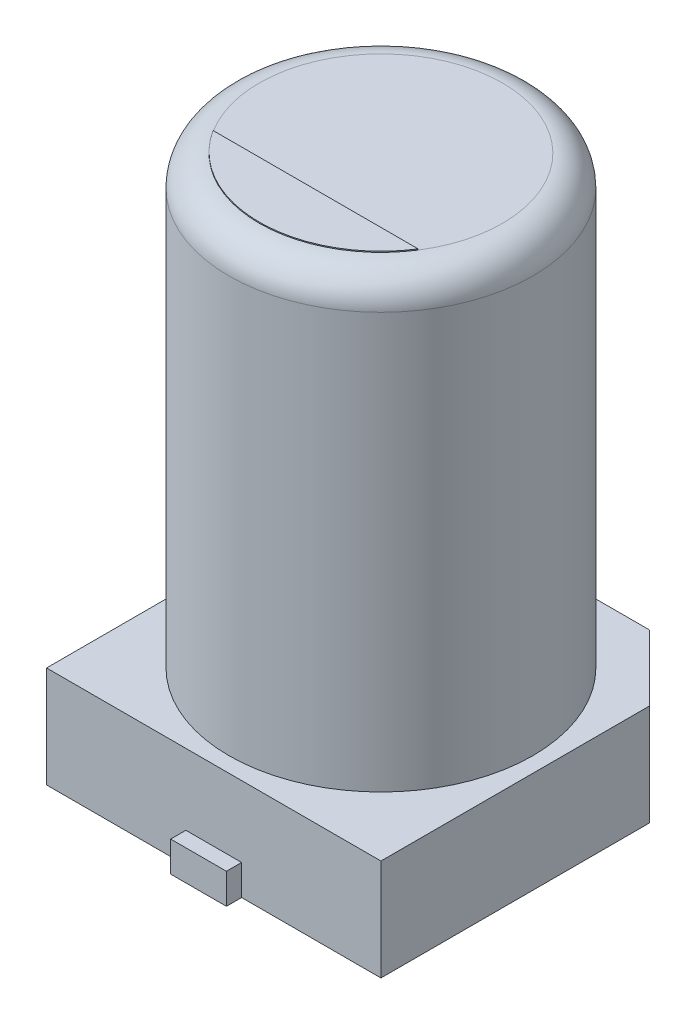
ISO-10303-21;
HEADER;
FILE_DESCRIPTION(('STEP AP214'),'2;1');
FILE_NAME('part.step','',(''),(''),'','','');
FILE_SCHEMA(('AUTOMOTIVE_DESIGN { 1 0 10303 214 1 1 1 1 }'));
ENDSEC;
DATA;
#1=APPLICATION_CONTEXT('core data for automotive mechanical design processes');
#2=APPLICATION_PROTOCOL_DEFINITION('international standard','automotive_design',2000,#1);
#3=PRODUCT_CONTEXT('',#1,'mechanical');
#4=PRODUCT('Part','Part','',(#3));
#5=PRODUCT_RELATED_PRODUCT_CATEGORY('part','',(#4));
#6=PRODUCT_DEFINITION_FORMATION('','',#4);
#7=PRODUCT_DEFINITION_CONTEXT('part definition',#1,'design');
#8=PRODUCT_DEFINITION('design','',#6,#7);
#9=PRODUCT_DEFINITION_SHAPE('','',#8);
#10=(LENGTH_UNIT() NAMED_UNIT(*) SI_UNIT(.MILLI.,.METRE.));
#11=(NAMED_UNIT(*) PLANE_ANGLE_UNIT() SI_UNIT($,.RADIAN.));
#12=(NAMED_UNIT(*) SI_UNIT($,.STERADIAN.) SOLID_ANGLE_UNIT());
#13=UNCERTAINTY_MEASURE_WITH_UNIT(LENGTH_MEASURE(1.E-05),#10,'distance_accuracy_value','');
#14=(GEOMETRIC_REPRESENTATION_CONTEXT(3) GLOBAL_UNCERTAINTY_ASSIGNED_CONTEXT((#13)) GLOBAL_UNIT_ASSIGNED_CONTEXT((#10,
#11,#12)) REPRESENTATION_CONTEXT('',''));
#15=CARTESIAN_POINT('',(0.,0.,0.));
#16=DIRECTION('',(0.,0.,1.));
#17=DIRECTION('',(1.,0.,0.));
#18=AXIS2_PLACEMENT_3D('',#15,#16,#17);
#19=CARTESIAN_POINT('',(0.,5.4,0.));
#20=DIRECTION('',(0.,1.,0.));
#21=DIRECTION('',(0.,0.,1.));
#22=AXIS2_PLACEMENT_3D('',#19,#20,#21);
#23=PLANE('',#22);
#24=CARTESIAN_POINT('',(0.,5.4,0.));
#25=DIRECTION('',(0.,1.,0.));
#26=DIRECTION('',(0.,0.,1.));
#27=AXIS2_PLACEMENT_3D('',#24,#25,#26);
#28=CIRCLE('',#27,1.2);
#29=CARTESIAN_POINT('',(1.01200566457573,5.4,0.644860089373367));
#30=VERTEX_POINT('',#29);
#31=CARTESIAN_POINT('',(-1.01200566457573,5.4,0.644860089373367));
#32=VERTEX_POINT('',#31);
#33=EDGE_CURVE('E221',#30,#32,#28,.T.);
#34=ORIENTED_EDGE('',*,*,#33,.T.);
#35=DIRECTION('',(-1.,0.,0.));
#36=VECTOR('',#35,1.);
#37=CARTESIAN_POINT('',(1.01200566457573,5.4,0.644860089373367));
#38=LINE('',#37,#36);
#39=EDGE_CURVE('E159',#30,#32,#38,.T.);
#40=ORIENTED_EDGE('',*,*,#39,.F.);
#41=EDGE_LOOP('',(#34,#40));
#42=FACE_BOUND('',#41,.T.);
#43=ADVANCED_FACE('F33',(#42),#23,.T.);
#44=CARTESIAN_POINT('',(-1.,1.,-1.65));
#45=DIRECTION('',(0.,0.,1.));
#46=DIRECTION('',(1.,0.,0.));
#47=AXIS2_PLACEMENT_3D('',#44,#45,#46);
#48=PLANE('',#47);
#49=DIRECTION('',(0.,-1.,0.));
#50=VECTOR('',#49,1.);
#51=CARTESIAN_POINT('',(0.275,1.,-1.65));
#52=LINE('',#51,#50);
#53=CARTESIAN_POINT('',(0.275,0.3,-1.65));
#54=VERTEX_POINT('',#53);
#55=CARTESIAN_POINT('',(0.275,0.,-1.65));
#56=VERTEX_POINT('',#55);
#57=EDGE_CURVE('E188',#54,#56,#52,.T.);
#58=ORIENTED_EDGE('',*,*,#57,.F.);
#59=DIRECTION('',(-1.,0.,0.));
#60=VECTOR('',#59,1.);
#61=CARTESIAN_POINT('',(-1.,0.3,-1.65));
#62=LINE('',#61,#60);
#63=CARTESIAN_POINT('',(-0.275,0.3,-1.65));
#64=VERTEX_POINT('',#63);
#65=EDGE_CURVE('E11',#54,#64,#62,.T.);
#66=ORIENTED_EDGE('',*,*,#65,.T.);
#67=DIRECTION('',(0.,1.,0.));
#68=VECTOR('',#67,1.);
#69=CARTESIAN_POINT('',(-0.275,1.,-1.65));
#70=LINE('',#69,#68);
#71=CARTESIAN_POINT('',(-0.275,0.,-1.65));
#72=VERTEX_POINT('',#71);
#73=EDGE_CURVE('E186',#72,#64,#70,.T.);
#74=ORIENTED_EDGE('',*,*,#73,.F.);
#75=DIRECTION('',(-1.,0.,0.));
#76=VECTOR('',#75,1.);
#77=CARTESIAN_POINT('',(-1.,0.,-1.65));
#78=LINE('',#77,#76);
#79=CARTESIAN_POINT('',(-1.,0.,-1.65));
#80=VERTEX_POINT('',#79);
#81=EDGE_CURVE('E242',#72,#80,#78,.T.);
#82=ORIENTED_EDGE('',*,*,#81,.T.);
#83=DIRECTION('',(0.,-1.,0.));
#84=VECTOR('',#83,1.);
#85=CARTESIAN_POINT('',(-1.,1.,-1.65));
#86=LINE('',#85,#84);
#87=CARTESIAN_POINT('',(-1.,1.,-1.65));
#88=VERTEX_POINT('',#87);
#89=EDGE_CURVE('E259',#88,#80,#86,.T.);
#90=ORIENTED_EDGE('',*,*,#89,.F.);
#91=DIRECTION('',(-1.,0.,0.));
#92=VECTOR('',#91,1.);
#93=CARTESIAN_POINT('',(-1.,1.,-1.65));
#94=LINE('',#93,#92);
#95=CARTESIAN_POINT('',(1.,1.,-1.65));
#96=VERTEX_POINT('',#95);
#97=EDGE_CURVE('E229',#96,#88,#94,.T.);
#98=ORIENTED_EDGE('',*,*,#97,.F.);
#99=DIRECTION('',(0.,-1.,0.));
#100=VECTOR('',#99,1.);
#101=CARTESIAN_POINT('',(1.,1.,-1.65));
#102=LINE('',#101,#100);
#103=CARTESIAN_POINT('',(1.,0.,-1.65));
#104=VERTEX_POINT('',#103);
#105=EDGE_CURVE('E262',#96,#104,#102,.T.);
#106=ORIENTED_EDGE('',*,*,#105,.T.);
#107=EDGE_CURVE('E243',#104,#56,#78,.T.);
#108=ORIENTED_EDGE('',*,*,#107,.T.);
#109=EDGE_LOOP('',(#58,#66,#74,#82,#90,#98,#106,#108));
#110=FACE_BOUND('',#109,.T.);
#111=ADVANCED_FACE('F319',(#110),#48,.F.);
#112=CARTESIAN_POINT('',(1.65,1.,1.65));
#113=DIRECTION('',(0.,0.,-1.));
#114=DIRECTION('',(-1.,0.,0.));
#115=AXIS2_PLACEMENT_3D('',#112,#113,#114);
#116=PLANE('',#115);
#117=DIRECTION('',(0.,-1.,0.));
#118=VECTOR('',#117,1.);
#119=CARTESIAN_POINT('',(-0.275,1.,1.65));
#120=LINE('',#119,#118);
#121=CARTESIAN_POINT('',(-0.275,0.3,1.65));
#122=VERTEX_POINT('',#121);
#123=CARTESIAN_POINT('',(-0.275,0.,1.65));
#124=VERTEX_POINT('',#123);
#125=EDGE_CURVE('E214',#122,#124,#120,.T.);
#126=ORIENTED_EDGE('',*,*,#125,.F.);
#127=DIRECTION('',(-1.,0.,0.));
#128=VECTOR('',#127,1.);
#129=CARTESIAN_POINT('',(1.65,0.3,1.65));
#130=LINE('',#129,#128);
#131=CARTESIAN_POINT('',(0.275,0.3,1.65));
#132=VERTEX_POINT('',#131);
#133=EDGE_CURVE('E41',#132,#122,#130,.T.);
#134=ORIENTED_EDGE('',*,*,#133,.F.);
#135=DIRECTION('',(0.,1.,0.));
#136=VECTOR('',#135,1.);
#137=CARTESIAN_POINT('',(0.275,1.,1.65));
#138=LINE('',#137,#136);
#139=CARTESIAN_POINT('',(0.275,0.,1.65));
#140=VERTEX_POINT('',#139);
#141=EDGE_CURVE('E211',#140,#132,#138,.T.);
#142=ORIENTED_EDGE('',*,*,#141,.F.);
#143=DIRECTION('',(1.,0.,0.));
#144=VECTOR('',#143,1.);
#145=CARTESIAN_POINT('',(1.65,0.,1.65));
#146=LINE('',#145,#144);
#147=CARTESIAN_POINT('',(1.65,0.,1.65));
#148=VERTEX_POINT('',#147);
#149=EDGE_CURVE('E249',#140,#148,#146,.T.);
#150=ORIENTED_EDGE('',*,*,#149,.T.);
#151=DIRECTION('',(0.,-1.,0.));
#152=VECTOR('',#151,1.);
#153=CARTESIAN_POINT('',(1.65,1.,1.65));
#154=LINE('',#153,#152);
#155=CARTESIAN_POINT('',(1.65,1.,1.65));
#156=VERTEX_POINT('',#155);
#157=EDGE_CURVE('E237',#156,#148,#154,.T.);
#158=ORIENTED_EDGE('',*,*,#157,.F.);
#159=DIRECTION('',(1.,0.,0.));
#160=VECTOR('',#159,1.);
#161=CARTESIAN_POINT('',(1.65,1.,1.65));
#162=LINE('',#161,#160);
#163=CARTESIAN_POINT('',(-1.65,1.,1.65));
#164=VERTEX_POINT('',#163);
#165=EDGE_CURVE('E235',#164,#156,#162,.T.);
#166=ORIENTED_EDGE('',*,*,#165,.F.);
#167=DIRECTION('',(0.,-1.,0.));
#168=VECTOR('',#167,1.);
#169=CARTESIAN_POINT('',(-1.65,1.,1.65));
#170=LINE('',#169,#168);
#171=CARTESIAN_POINT('',(-1.65,0.,1.65));
#172=VERTEX_POINT('',#171);
#173=EDGE_CURVE('E253',#164,#172,#170,.T.);
#174=ORIENTED_EDGE('',*,*,#173,.T.);
#175=EDGE_CURVE('E227',#172,#124,#146,.T.);
#176=ORIENTED_EDGE('',*,*,#175,.T.);
#177=EDGE_LOOP('',(#126,#134,#142,#150,#158,#166,#174,#176));
#178=FACE_BOUND('',#177,.T.);
#179=ADVANCED_FACE('F289',(#178),#116,.F.);
#180=CARTESIAN_POINT('',(1.65,1.,-1.));
#181=DIRECTION('',(-1.,0.,0.));
#182=DIRECTION('',(0.,0.,1.));
#183=AXIS2_PLACEMENT_3D('',#180,#181,#182);
#184=PLANE('',#183);
#185=DIRECTION('',(0.,0.,-1.));
#186=VECTOR('',#185,1.);
#187=CARTESIAN_POINT('',(1.65,0.,-1.));
#188=LINE('',#187,#186);
#189=CARTESIAN_POINT('',(1.65,0.,-1.));
#190=VERTEX_POINT('',#189);
#191=EDGE_CURVE('E217',#148,#190,#188,.T.);
#192=ORIENTED_EDGE('',*,*,#191,.T.);
#193=DIRECTION('',(0.,-1.,0.));
#194=VECTOR('',#193,1.);
#195=CARTESIAN_POINT('',(1.65,1.,-1.));
#196=LINE('',#195,#194);
#197=CARTESIAN_POINT('',(1.65,1.,-1.));
#198=VERTEX_POINT('',#197);
#199=EDGE_CURVE('E222',#198,#190,#196,.T.);
#200=ORIENTED_EDGE('',*,*,#199,.F.);
#201=DIRECTION('',(0.,0.,-1.));
#202=VECTOR('',#201,1.);
#203=CARTESIAN_POINT('',(1.65,1.,-1.));
#204=LINE('',#203,#202);
#205=EDGE_CURVE('E223',#156,#198,#204,.T.);
#206=ORIENTED_EDGE('',*,*,#205,.F.);
#207=ORIENTED_EDGE('',*,*,#157,.T.);
#208=EDGE_LOOP('',(#192,#200,#206,#207));
#209=FACE_BOUND('',#208,.T.);
#210=ADVANCED_FACE('F296',(#209),#184,.F.);
#211=CARTESIAN_POINT('',(1.,1.,-1.65));
#212=DIRECTION('',(-0.707106781186548,0.,0.707106781186547));
#213=DIRECTION('',(0.707106781186547,0.,0.707106781186548));
#214=AXIS2_PLACEMENT_3D('',#211,#212,#213);
#215=PLANE('',#214);
#216=DIRECTION('',(-0.707106781186547,0.,-0.707106781186548));
#217=VECTOR('',#216,1.);
#218=CARTESIAN_POINT('',(1.,0.,-1.65));
#219=LINE('',#218,#217);
#220=EDGE_CURVE('E240',#190,#104,#219,.T.);
#221=ORIENTED_EDGE('',*,*,#220,.T.);
#222=ORIENTED_EDGE('',*,*,#105,.F.);
#223=DIRECTION('',(-0.707106781186547,0.,-0.707106781186548));
#224=VECTOR('',#223,1.);
#225=CARTESIAN_POINT('',(1.,1.,-1.65));
#226=LINE('',#225,#224);
#227=EDGE_CURVE('E226',#198,#96,#226,.T.);
#228=ORIENTED_EDGE('',*,*,#227,.F.);
#229=ORIENTED_EDGE('',*,*,#199,.T.);
#230=EDGE_LOOP('',(#221,#222,#228,#229));
#231=FACE_BOUND('',#230,.T.);
#232=ADVANCED_FACE('F303',(#231),#215,.F.);
#233=CARTESIAN_POINT('',(-1.65,1.,-1.));
#234=DIRECTION('',(0.707106781186548,0.,0.707106781186547));
#235=DIRECTION('',(0.707106781186547,0.,-0.707106781186548));
#236=AXIS2_PLACEMENT_3D('',#233,#234,#235);
#237=PLANE('',#236);
#238=DIRECTION('',(-0.707106781186547,0.,0.707106781186548));
#239=VECTOR('',#238,1.);
#240=CARTESIAN_POINT('',(-1.65,0.,-1.));
#241=LINE('',#240,#239);
#242=CARTESIAN_POINT('',(-1.65,0.,-1.));
#243=VERTEX_POINT('',#242);
#244=EDGE_CURVE('E245',#80,#243,#241,.T.);
#245=ORIENTED_EDGE('',*,*,#244,.T.);
#246=DIRECTION('',(0.,-1.,0.));
#247=VECTOR('',#246,1.);
#248=CARTESIAN_POINT('',(-1.65,1.,-1.));
#249=LINE('',#248,#247);
#250=CARTESIAN_POINT('',(-1.65,1.,-1.));
#251=VERTEX_POINT('',#250);
#252=EDGE_CURVE('E256',#251,#243,#249,.T.);
#253=ORIENTED_EDGE('',*,*,#252,.F.);
#254=DIRECTION('',(-0.707106781186547,0.,0.707106781186548));
#255=VECTOR('',#254,1.);
#256=CARTESIAN_POINT('',(-1.65,1.,-1.));
#257=LINE('',#256,#255);
#258=EDGE_CURVE('E231',#88,#251,#257,.T.);
#259=ORIENTED_EDGE('',*,*,#258,.F.);
#260=ORIENTED_EDGE('',*,*,#89,.T.);
#261=EDGE_LOOP('',(#245,#253,#259,#260));
#262=FACE_BOUND('',#261,.T.);
#263=ADVANCED_FACE('F317',(#262),#237,.F.);
#264=CARTESIAN_POINT('',(-1.65,1.,1.65));
#265=DIRECTION('',(1.,0.,0.));
#266=DIRECTION('',(0.,0.,-1.));
#267=AXIS2_PLACEMENT_3D('',#264,#265,#266);
#268=PLANE('',#267);
#269=DIRECTION('',(0.,0.,1.));
#270=VECTOR('',#269,1.);
#271=CARTESIAN_POINT('',(-1.65,0.,1.65));
#272=LINE('',#271,#270);
#273=EDGE_CURVE('E247',#243,#172,#272,.T.);
#274=ORIENTED_EDGE('',*,*,#273,.T.);
#275=ORIENTED_EDGE('',*,*,#173,.F.);
#276=DIRECTION('',(0.,0.,1.));
#277=VECTOR('',#276,1.);
#278=CARTESIAN_POINT('',(-1.65,1.,1.65));
#279=LINE('',#278,#277);
#280=EDGE_CURVE('E233',#251,#164,#279,.T.);
#281=ORIENTED_EDGE('',*,*,#280,.F.);
#282=ORIENTED_EDGE('',*,*,#252,.T.);
#283=EDGE_LOOP('',(#274,#275,#281,#282));
#284=FACE_BOUND('',#283,.T.);
#285=ADVANCED_FACE('F313',(#284),#268,.F.);
#286=CARTESIAN_POINT('',(0.,1.,0.));
#287=DIRECTION('',(0.,-1.,0.));
#288=DIRECTION('',(0.,0.,-1.));
#289=AXIS2_PLACEMENT_3D('',#286,#287,#288);
#290=PLANE('',#289);
#291=CARTESIAN_POINT('',(0.,1.,0.));
#292=DIRECTION('',(0.,-1.,0.));
#293=DIRECTION('',(0.,0.,-1.));
#294=AXIS2_PLACEMENT_3D('',#291,#292,#293);
#295=CIRCLE('',#294,1.5);
#296=CARTESIAN_POINT('',(0.,1.,-1.5));
#297=VERTEX_POINT('',#296);
#298=EDGE_CURVE('E218',#297,#297,#295,.F.);
#299=ORIENTED_EDGE('',*,*,#298,.F.);
#300=EDGE_LOOP('',(#299));
#301=FACE_BOUND('',#300,.T.);
#302=ORIENTED_EDGE('',*,*,#205,.T.);
#303=ORIENTED_EDGE('',*,*,#227,.T.);
#304=ORIENTED_EDGE('',*,*,#97,.T.);
#305=ORIENTED_EDGE('',*,*,#258,.T.);
#306=ORIENTED_EDGE('',*,*,#280,.T.);
#307=ORIENTED_EDGE('',*,*,#165,.T.);
#308=EDGE_LOOP('',(#302,#303,#304,#305,#306,#307));
#309=FACE_BOUND('',#308,.T.);
#310=ADVANCED_FACE('F306',(#301,#309),#290,.F.);
#311=CARTESIAN_POINT('',(0.,0.,0.));
#312=DIRECTION('',(0.,-1.,0.));
#313=DIRECTION('',(0.,0.,-1.));
#314=AXIS2_PLACEMENT_3D('',#311,#312,#313);
#315=PLANE('',#314);
#316=ORIENTED_EDGE('',*,*,#81,.F.);
#317=DIRECTION('',(0.,0.,1.));
#318=VECTOR('',#317,1.);
#319=CARTESIAN_POINT('',(-0.275,0.,-0.3));
#320=LINE('',#319,#318);
#321=CARTESIAN_POINT('',(-0.275,0.,-1.8));
#322=VERTEX_POINT('',#321);
#323=EDGE_CURVE('E172',#322,#72,#320,.T.);
#324=ORIENTED_EDGE('',*,*,#323,.F.);
#325=DIRECTION('',(-1.,0.,0.));
#326=VECTOR('',#325,1.);
#327=CARTESIAN_POINT('',(0.275,0.,-1.8));
#328=LINE('',#327,#326);
#329=CARTESIAN_POINT('',(0.275,0.,-1.8));
#330=VERTEX_POINT('',#329);
#331=EDGE_CURVE('E164',#330,#322,#328,.T.);
#332=ORIENTED_EDGE('',*,*,#331,.F.);
#333=DIRECTION('',(0.,0.,-1.));
#334=VECTOR('',#333,1.);
#335=CARTESIAN_POINT('',(0.275,0.,-0.3));
#336=LINE('',#335,#334);
#337=EDGE_CURVE('E162',#56,#330,#336,.T.);
#338=ORIENTED_EDGE('',*,*,#337,.F.);
#339=ORIENTED_EDGE('',*,*,#107,.F.);
#340=ORIENTED_EDGE('',*,*,#220,.F.);
#341=ORIENTED_EDGE('',*,*,#191,.F.);
#342=ORIENTED_EDGE('',*,*,#149,.F.);
#343=DIRECTION('',(0.,0.,-1.));
#344=VECTOR('',#343,1.);
#345=CARTESIAN_POINT('',(0.275,0.,0.3));
#346=LINE('',#345,#344);
#347=CARTESIAN_POINT('',(0.275,0.,1.8));
#348=VERTEX_POINT('',#347);
#349=EDGE_CURVE('E195',#348,#140,#346,.T.);
#350=ORIENTED_EDGE('',*,*,#349,.F.);
#351=DIRECTION('',(1.,0.,0.));
#352=VECTOR('',#351,1.);
#353=CARTESIAN_POINT('',(0.275,0.,1.8));
#354=LINE('',#353,#352);
#355=CARTESIAN_POINT('',(-0.275,0.,1.8));
#356=VERTEX_POINT('',#355);
#357=EDGE_CURVE('E202',#356,#348,#354,.T.);
#358=ORIENTED_EDGE('',*,*,#357,.F.);
#359=DIRECTION('',(0.,0.,1.));
#360=VECTOR('',#359,1.);
#361=CARTESIAN_POINT('',(-0.275,0.,0.3));
#362=LINE('',#361,#360);
#363=EDGE_CURVE('E191',#124,#356,#362,.T.);
#364=ORIENTED_EDGE('',*,*,#363,.F.);
#365=ORIENTED_EDGE('',*,*,#175,.F.);
#366=ORIENTED_EDGE('',*,*,#273,.F.);
#367=ORIENTED_EDGE('',*,*,#244,.F.);
#368=EDGE_LOOP('',(#316,#324,#332,#338,#339,#340,#341,#342,#350,#358,#364,#365,#366,#367));
#369=FACE_BOUND('',#368,.T.);
#370=ADVANCED_FACE('F298',(#369),#315,.T.);
#371=CARTESIAN_POINT('',(0.,5.4,0.));
#372=DIRECTION('',(0.,-1.,0.));
#373=DIRECTION('',(0.,0.,-1.));
#374=AXIS2_PLACEMENT_3D('',#371,#372,#373);
#375=CYLINDRICAL_SURFACE('',#374,1.5);
#376=CARTESIAN_POINT('',(0.,5.1,0.));
#377=DIRECTION('',(0.,1.,0.));
#378=DIRECTION('',(0.,0.,1.));
#379=AXIS2_PLACEMENT_3D('',#376,#377,#378);
#380=CIRCLE('',#379,1.5);
#381=CARTESIAN_POINT('',(0.,5.1,1.5));
#382=VERTEX_POINT('',#381);
#383=EDGE_CURVE('E268',#382,#382,#380,.F.);
#384=ORIENTED_EDGE('',*,*,#383,.T.);
#385=EDGE_LOOP('',(#384));
#386=FACE_BOUND('',#385,.T.);
#387=ORIENTED_EDGE('',*,*,#298,.T.);
#388=EDGE_LOOP('',(#387));
#389=FACE_BOUND('',#388,.T.);
#390=ADVANCED_FACE('F354',(#386,#389),#375,.T.);
#391=CARTESIAN_POINT('',(0.,5.1,0.));
#392=DIRECTION('',(0.,1.,0.));
#393=DIRECTION('',(0.,0.,1.));
#394=AXIS2_PLACEMENT_3D('',#391,#392,#393);
#395=TOROIDAL_SURFACE('',#394,1.2,0.3);
#396=ORIENTED_EDGE('',*,*,#383,.F.);
#397=EDGE_LOOP('',(#396));
#398=FACE_BOUND('',#397,.T.);
#399=ORIENTED_EDGE('',*,*,#33,.F.);
#400=CARTESIAN_POINT('',(0.,5.4,0.));
#401=DIRECTION('',(0.,1.,0.));
#402=DIRECTION('',(0.,0.,-1.));
#403=AXIS2_PLACEMENT_3D('',#400,#401,#402);
#404=CIRCLE('',#403,1.2);
#405=EDGE_CURVE('E47',#32,#30,#404,.T.);
#406=ORIENTED_EDGE('',*,*,#405,.F.);
#407=EDGE_LOOP('',(#399,#406));
#408=FACE_BOUND('',#407,.T.);
#409=ADVANCED_FACE('F35',(#398,#408),#395,.T.);
#410=CARTESIAN_POINT('',(0.,0.3,0.));
#411=DIRECTION('',(0.,-1.,0.));
#412=DIRECTION('',(0.,0.,-1.));
#413=AXIS2_PLACEMENT_3D('',#410,#411,#412);
#414=PLANE('',#413);
#415=DIRECTION('',(0.,0.,-1.));
#416=VECTOR('',#415,1.);
#417=CARTESIAN_POINT('',(0.275,0.3,0.3));
#418=LINE('',#417,#416);
#419=CARTESIAN_POINT('',(0.275,0.3,1.8));
#420=VERTEX_POINT('',#419);
#421=EDGE_CURVE('E197',#420,#132,#418,.T.);
#422=ORIENTED_EDGE('',*,*,#421,.T.);
#423=ORIENTED_EDGE('',*,*,#133,.T.);
#424=DIRECTION('',(0.,0.,1.));
#425=VECTOR('',#424,1.);
#426=CARTESIAN_POINT('',(-0.275,0.3,0.3));
#427=LINE('',#426,#425);
#428=CARTESIAN_POINT('',(-0.275,0.3,1.8));
#429=VERTEX_POINT('',#428);
#430=EDGE_CURVE('E192',#122,#429,#427,.T.);
#431=ORIENTED_EDGE('',*,*,#430,.T.);
#432=DIRECTION('',(1.,0.,0.));
#433=VECTOR('',#432,1.);
#434=CARTESIAN_POINT('',(0.275,0.3,1.8));
#435=LINE('',#434,#433);
#436=EDGE_CURVE('E194',#429,#420,#435,.T.);
#437=ORIENTED_EDGE('',*,*,#436,.T.);
#438=EDGE_LOOP('',(#422,#423,#431,#437));
#439=FACE_BOUND('',#438,.T.);
#440=ADVANCED_FACE('F273',(#439),#414,.F.);
#441=CARTESIAN_POINT('',(-0.275,0.3,0.3));
#442=DIRECTION('',(1.,0.,0.));
#443=DIRECTION('',(0.,0.,-1.));
#444=AXIS2_PLACEMENT_3D('',#441,#442,#443);
#445=PLANE('',#444);
#446=ORIENTED_EDGE('',*,*,#430,.F.);
#447=ORIENTED_EDGE('',*,*,#125,.T.);
#448=ORIENTED_EDGE('',*,*,#363,.T.);
#449=DIRECTION('',(0.,-1.,0.));
#450=VECTOR('',#449,1.);
#451=CARTESIAN_POINT('',(-0.275,0.3,1.8));
#452=LINE('',#451,#450);
#453=EDGE_CURVE('E208',#429,#356,#452,.T.);
#454=ORIENTED_EDGE('',*,*,#453,.F.);
#455=EDGE_LOOP('',(#446,#447,#448,#454));
#456=FACE_BOUND('',#455,.T.);
#457=ADVANCED_FACE('F280',(#456),#445,.F.);
#458=CARTESIAN_POINT('',(0.275,0.3,0.3));
#459=DIRECTION('',(-1.,0.,0.));
#460=DIRECTION('',(0.,0.,1.));
#461=AXIS2_PLACEMENT_3D('',#458,#459,#460);
#462=PLANE('',#461);
#463=ORIENTED_EDGE('',*,*,#349,.T.);
#464=ORIENTED_EDGE('',*,*,#141,.T.);
#465=ORIENTED_EDGE('',*,*,#421,.F.);
#466=DIRECTION('',(0.,-1.,0.));
#467=VECTOR('',#466,1.);
#468=CARTESIAN_POINT('',(0.275,0.3,1.8));
#469=LINE('',#468,#467);
#470=EDGE_CURVE('E200',#420,#348,#469,.T.);
#471=ORIENTED_EDGE('',*,*,#470,.T.);
#472=EDGE_LOOP('',(#463,#464,#465,#471));
#473=FACE_BOUND('',#472,.T.);
#474=ADVANCED_FACE('F288',(#473),#462,.F.);
#475=CARTESIAN_POINT('',(0.275,0.3,1.8));
#476=DIRECTION('',(0.,0.,-1.));
#477=DIRECTION('',(-1.,0.,0.));
#478=AXIS2_PLACEMENT_3D('',#475,#476,#477);
#479=PLANE('',#478);
#480=ORIENTED_EDGE('',*,*,#357,.T.);
#481=ORIENTED_EDGE('',*,*,#470,.F.);
#482=ORIENTED_EDGE('',*,*,#436,.F.);
#483=ORIENTED_EDGE('',*,*,#453,.T.);
#484=EDGE_LOOP('',(#480,#481,#482,#483));
#485=FACE_BOUND('',#484,.T.);
#486=ADVANCED_FACE('F284',(#485),#479,.F.);
#487=CARTESIAN_POINT('',(0.,0.3,0.));
#488=DIRECTION('',(0.,1.,0.));
#489=DIRECTION('',(0.,0.,1.));
#490=AXIS2_PLACEMENT_3D('',#487,#488,#489);
#491=PLANE('',#490);
#492=ORIENTED_EDGE('',*,*,#65,.F.);
#493=DIRECTION('',(0.,0.,-1.));
#494=VECTOR('',#493,1.);
#495=CARTESIAN_POINT('',(0.275,0.3,-0.3));
#496=LINE('',#495,#494);
#497=CARTESIAN_POINT('',(0.275,0.3,-1.8));
#498=VERTEX_POINT('',#497);
#499=EDGE_CURVE('E169',#54,#498,#496,.T.);
#500=ORIENTED_EDGE('',*,*,#499,.T.);
#501=DIRECTION('',(-1.,0.,0.));
#502=VECTOR('',#501,1.);
#503=CARTESIAN_POINT('',(0.275,0.3,-1.8));
#504=LINE('',#503,#502);
#505=CARTESIAN_POINT('',(-0.275,0.3,-1.8));
#506=VERTEX_POINT('',#505);
#507=EDGE_CURVE('E171',#498,#506,#504,.T.);
#508=ORIENTED_EDGE('',*,*,#507,.T.);
#509=DIRECTION('',(0.,0.,1.));
#510=VECTOR('',#509,1.);
#511=CARTESIAN_POINT('',(-0.275,0.3,-0.3));
#512=LINE('',#511,#510);
#513=EDGE_CURVE('E174',#506,#64,#512,.T.);
#514=ORIENTED_EDGE('',*,*,#513,.T.);
#515=EDGE_LOOP('',(#492,#500,#508,#514));
#516=FACE_BOUND('',#515,.T.);
#517=ADVANCED_FACE('F334',(#516),#491,.T.);
#518=CARTESIAN_POINT('',(0.275,0.3,-0.3));
#519=DIRECTION('',(-1.,0.,0.));
#520=DIRECTION('',(0.,0.,1.));
#521=AXIS2_PLACEMENT_3D('',#518,#519,#520);
#522=PLANE('',#521);
#523=ORIENTED_EDGE('',*,*,#499,.F.);
#524=ORIENTED_EDGE('',*,*,#57,.T.);
#525=ORIENTED_EDGE('',*,*,#337,.T.);
#526=DIRECTION('',(0.,-1.,0.));
#527=VECTOR('',#526,1.);
#528=CARTESIAN_POINT('',(0.275,0.3,-1.8));
#529=LINE('',#528,#527);
#530=EDGE_CURVE('E183',#498,#330,#529,.T.);
#531=ORIENTED_EDGE('',*,*,#530,.F.);
#532=EDGE_LOOP('',(#523,#524,#525,#531));
#533=FACE_BOUND('',#532,.T.);
#534=ADVANCED_FACE('F332',(#533),#522,.F.);
#535=CARTESIAN_POINT('',(-0.275,0.3,-0.3));
#536=DIRECTION('',(1.,0.,0.));
#537=DIRECTION('',(0.,0.,-1.));
#538=AXIS2_PLACEMENT_3D('',#535,#536,#537);
#539=PLANE('',#538);
#540=ORIENTED_EDGE('',*,*,#323,.T.);
#541=ORIENTED_EDGE('',*,*,#73,.T.);
#542=ORIENTED_EDGE('',*,*,#513,.F.);
#543=DIRECTION('',(0.,-1.,0.));
#544=VECTOR('',#543,1.);
#545=CARTESIAN_POINT('',(-0.275,0.3,-1.8));
#546=LINE('',#545,#544);
#547=EDGE_CURVE('E176',#506,#322,#546,.T.);
#548=ORIENTED_EDGE('',*,*,#547,.T.);
#549=EDGE_LOOP('',(#540,#541,#542,#548));
#550=FACE_BOUND('',#549,.T.);
#551=ADVANCED_FACE('F323',(#550),#539,.F.);
#552=CARTESIAN_POINT('',(0.275,0.3,-1.8));
#553=DIRECTION('',(0.,0.,1.));
#554=DIRECTION('',(1.,0.,0.));
#555=AXIS2_PLACEMENT_3D('',#552,#553,#554);
#556=PLANE('',#555);
#557=ORIENTED_EDGE('',*,*,#331,.T.);
#558=ORIENTED_EDGE('',*,*,#547,.F.);
#559=ORIENTED_EDGE('',*,*,#507,.F.);
#560=ORIENTED_EDGE('',*,*,#530,.T.);
#561=EDGE_LOOP('',(#557,#558,#559,#560));
#562=FACE_BOUND('',#561,.T.);
#563=ADVANCED_FACE('F328',(#562),#556,.F.);
#564=CARTESIAN_POINT('',(0.,5.41,0.));
#565=DIRECTION('',(0.,-1.,0.));
#566=DIRECTION('',(0.,0.,-1.));
#567=AXIS2_PLACEMENT_3D('',#564,#565,#566);
#568=CYLINDRICAL_SURFACE('',#567,1.2);
#569=ORIENTED_EDGE('',*,*,#405,.T.);
#570=DIRECTION('',(0.,-1.,0.));
#571=VECTOR('',#570,1.);
#572=CARTESIAN_POINT('',(1.01200566457573,5.41,0.644860089373367));
#573=LINE('',#572,#571);
#574=CARTESIAN_POINT('',(1.01200566457573,5.41,0.644860089373367));
#575=VERTEX_POINT('',#574);
#576=EDGE_CURVE('E150',#575,#30,#573,.T.);
#577=ORIENTED_EDGE('',*,*,#576,.F.);
#578=CARTESIAN_POINT('',(0.,5.41,0.));
#579=DIRECTION('',(0.,1.,0.));
#580=DIRECTION('',(0.,0.,-1.));
#581=AXIS2_PLACEMENT_3D('',#578,#579,#580);
#582=CIRCLE('',#581,1.2);
#583=CARTESIAN_POINT('',(-1.01200566457573,5.41,0.644860089373367));
#584=VERTEX_POINT('',#583);
#585=EDGE_CURVE('E155',#584,#575,#582,.T.);
#586=ORIENTED_EDGE('',*,*,#585,.F.);
#587=DIRECTION('',(0.,-1.,0.));
#588=VECTOR('',#587,1.);
#589=CARTESIAN_POINT('',(-1.01200566457573,5.41,0.644860089373367));
#590=LINE('',#589,#588);
#591=EDGE_CURVE('E152',#584,#32,#590,.T.);
#592=ORIENTED_EDGE('',*,*,#591,.T.);
#593=EDGE_LOOP('',(#569,#577,#586,#592));
#594=FACE_BOUND('',#593,.T.);
#595=ADVANCED_FACE('F161',(#594),#568,.T.);
#596=CARTESIAN_POINT('',(1.01200566457573,5.41,0.644860089373367));
#597=DIRECTION('',(0.,0.,1.));
#598=DIRECTION('',(1.,0.,0.));
#599=AXIS2_PLACEMENT_3D('',#596,#597,#598);
#600=PLANE('',#599);
#601=ORIENTED_EDGE('',*,*,#39,.T.);
#602=ORIENTED_EDGE('',*,*,#591,.F.);
#603=DIRECTION('',(-1.,0.,0.));
#604=VECTOR('',#603,1.);
#605=CARTESIAN_POINT('',(1.01200566457573,5.41,0.644860089373367));
#606=LINE('',#605,#604);
#607=EDGE_CURVE('E145',#575,#584,#606,.T.);
#608=ORIENTED_EDGE('',*,*,#607,.F.);
#609=ORIENTED_EDGE('',*,*,#576,.T.);
#610=EDGE_LOOP('',(#601,#602,#608,#609));
#611=FACE_BOUND('',#610,.T.);
#612=ADVANCED_FACE('F148',(#611),#600,.F.);
#613=CARTESIAN_POINT('',(0.,5.41,0.));
#614=DIRECTION('',(0.,-1.,0.));
#615=DIRECTION('',(0.,0.,-1.));
#616=AXIS2_PLACEMENT_3D('',#613,#614,#615);
#617=PLANE('',#616);
#618=ORIENTED_EDGE('',*,*,#585,.T.);
#619=ORIENTED_EDGE('',*,*,#607,.T.);
#620=EDGE_LOOP('',(#618,#619));
#621=FACE_BOUND('',#620,.T.);
#622=ADVANCED_FACE('F157',(#621),#617,.F.);
#623=CLOSED_SHELL('',(#43,#111,#179,#210,#232,#263,#285,#310,#370,#390,#409,#440,#457,#474,#486,
#517,#534,#551,#563,#595,#612,#622));
#624=MANIFOLD_SOLID_BREP('B2',#623);
#625=ADVANCED_BREP_SHAPE_REPRESENTATION('',(#18,#624),#14);
#626=SHAPE_DEFINITION_REPRESENTATION(#9,#625);
ENDSEC;
END-ISO-10303-21;
